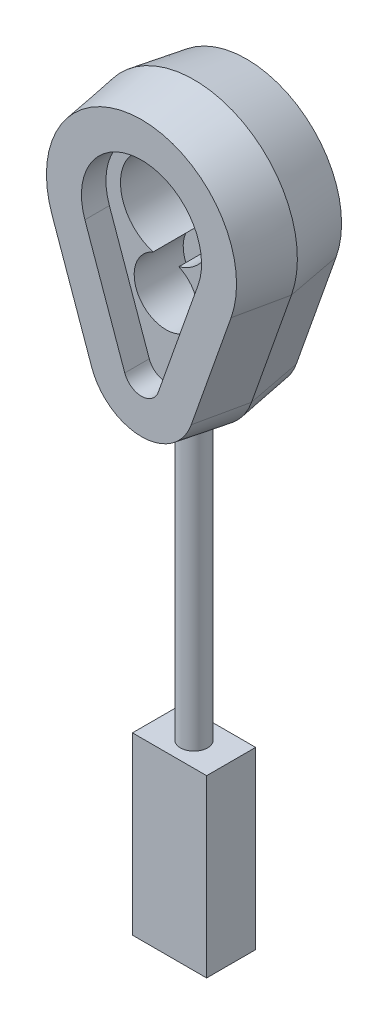
ISO-10303-21;
HEADER;
FILE_DESCRIPTION(('STEP AP214'),'2;1');
FILE_NAME('part.step','',(''),(''),'','','');
FILE_SCHEMA(('AUTOMOTIVE_DESIGN { 1 0 10303 214 1 1 1 1 }'));
ENDSEC;
DATA;
#1=APPLICATION_CONTEXT('core data for automotive mechanical design processes');
#2=APPLICATION_PROTOCOL_DEFINITION('international standard','automotive_design',2000,#1);
#3=PRODUCT_CONTEXT('',#1,'mechanical');
#4=PRODUCT('Part','Part','',(#3));
#5=PRODUCT_RELATED_PRODUCT_CATEGORY('part','',(#4));
#6=PRODUCT_DEFINITION_FORMATION('','',#4);
#7=PRODUCT_DEFINITION_CONTEXT('part definition',#1,'design');
#8=PRODUCT_DEFINITION('design','',#6,#7);
#9=PRODUCT_DEFINITION_SHAPE('','',#8);
#10=(LENGTH_UNIT() NAMED_UNIT(*) SI_UNIT(.MILLI.,.METRE.));
#11=(NAMED_UNIT(*) PLANE_ANGLE_UNIT() SI_UNIT($,.RADIAN.));
#12=(NAMED_UNIT(*) SI_UNIT($,.STERADIAN.) SOLID_ANGLE_UNIT());
#13=UNCERTAINTY_MEASURE_WITH_UNIT(LENGTH_MEASURE(1.E-05),#10,'distance_accuracy_value','');
#14=(GEOMETRIC_REPRESENTATION_CONTEXT(3) GLOBAL_UNCERTAINTY_ASSIGNED_CONTEXT((#13)) GLOBAL_UNIT_ASSIGNED_CONTEXT((#10,
#11,#12)) REPRESENTATION_CONTEXT('',''));
#15=CARTESIAN_POINT('',(0.,0.,0.));
#16=DIRECTION('',(0.,0.,1.));
#17=DIRECTION('',(1.,0.,0.));
#18=AXIS2_PLACEMENT_3D('',#15,#16,#17);
#19=CARTESIAN_POINT('',(0.,16.6037884330398,0.));
#20=DIRECTION('',(0.,-1.,0.));
#21=DIRECTION('',(0.,0.,-1.));
#22=AXIS2_PLACEMENT_3D('',#19,#20,#21);
#23=CYLINDRICAL_SURFACE('',#22,0.98409170703917);
#24=CARTESIAN_POINT('',(-0.98409168671586,-4.4192482256549,-0.000199999999999837));
#25=CARTESIAN_POINT('',(-0.984097085883015,-4.4148724557727,0.0267209709012039));
#26=CARTESIAN_POINT('',(-0.98299713720744,-4.41074650614178,0.0536709824800077));
#27=CARTESIAN_POINT('',(-0.978579087796314,-4.40301483989207,0.107464566228092));
#28=CARTESIAN_POINT('',(-0.975260887306968,-4.39940914667785,0.134308133556011));
#29=CARTESIAN_POINT('',(-0.961983461293486,-4.38941563602825,0.214334748337586));
#30=CARTESIAN_POINT('',(-0.948701468574549,-4.38383584753335,0.2671096010363));
#31=CARTESIAN_POINT('',(-0.913535319976374,-4.3748188937024,0.369930511176929));
#32=CARTESIAN_POINT('',(-0.891643294369421,-4.37138369601482,0.419974024336217));
#33=CARTESIAN_POINT('',(-0.839842823488599,-4.36639739341966,0.515815362262868));
#34=CARTESIAN_POINT('',(-0.809936427896995,-4.36484580733704,0.561614268567212));
#35=CARTESIAN_POINT('',(-0.743067752841407,-4.36319421527238,0.647486222640956));
#36=CARTESIAN_POINT('',(-0.706131512687204,-4.36308895408788,0.687579475797872));
#37=CARTESIAN_POINT('',(-0.626151520612784,-4.36379111371978,0.761133011531106));
#38=CARTESIAN_POINT('',(-0.583106115698386,-4.36459878196637,0.794591493003563));
#39=CARTESIAN_POINT('',(-0.491510686278028,-4.36660279706224,0.854330930791084));
#40=CARTESIAN_POINT('',(-0.442897274471061,-4.36780398505856,0.880514568109824));
#41=CARTESIAN_POINT('',(-0.341983157835609,-4.37009864561681,0.924397800519598));
#42=CARTESIAN_POINT('',(-0.289682684134218,-4.37119212492029,0.942097926866349));
#43=CARTESIAN_POINT('',(-0.182543730984046,-4.37291255498202,0.968595209420589));
#44=CARTESIAN_POINT('',(-0.127692382291647,-4.37353678583686,0.977340565319281));
#45=CARTESIAN_POINT('',(-0.0172954392057737,-4.37411710658356,0.985495261506718));
#46=CARTESIAN_POINT('',(0.0382501663635484,-4.37407318570592,0.984904451311981));
#47=CARTESIAN_POINT('',(0.148313027480209,-4.37333128579104,0.974416896527436));
#48=CARTESIAN_POINT('',(0.202832468550235,-4.37263490900796,0.964542948592992));
#49=CARTESIAN_POINT('',(0.309440593319927,-4.37080420151624,0.935804983113595));
#50=CARTESIAN_POINT('',(0.36152922758899,-4.36966986190595,0.916940782838701));
#51=CARTESIAN_POINT('',(0.46188064893609,-4.3673484208449,0.870723092959069));
#52=CARTESIAN_POINT('',(0.510137977867349,-4.36616124775254,0.843357755605639));
#53=CARTESIAN_POINT('',(0.601386133819344,-4.36424842739828,0.78091442004559));
#54=CARTESIAN_POINT('',(0.64437699227665,-4.36352277738136,0.745836467880537));
#55=CARTESIAN_POINT('',(0.72386382920801,-4.36310225510593,0.668964933705868));
#56=CARTESIAN_POINT('',(0.76036064329411,-4.36340725012951,0.627172217027998));
#57=CARTESIAN_POINT('',(0.82581390785112,-4.3655919967712,0.538072926534506));
#58=CARTESIAN_POINT('',(0.85476986934057,-4.36747185047664,0.490765995441183));
#59=CARTESIAN_POINT('',(0.90402520653008,-4.3731993149354,0.39262868986227));
#60=CARTESIAN_POINT('',(0.924418269097534,-4.37702455928714,0.341843921349668));
#61=CARTESIAN_POINT('',(0.956469007214356,-4.38685608266726,0.237818927856279));
#62=CARTESIAN_POINT('',(0.968136179945701,-4.39285997986361,0.184581439612925));
#63=CARTESIAN_POINT('',(0.978268869969302,-4.40281174786465,0.109147493491658));
#64=CARTESIAN_POINT('',(0.980459961800558,-4.40586554006172,0.087277531910676));
#65=CARTESIAN_POINT('',(0.983371662834753,-4.41230819462531,0.0435326663453332));
#66=CARTESIAN_POINT('',(0.984095126497143,-4.41569639309657,0.0216578548723957));
#67=CARTESIAN_POINT('',(0.98409168671586,-4.4192482256549,-0.000199999999999881));
#68=B_SPLINE_CURVE_WITH_KNOTS('',3,(#24,#25,#26,#27,#28,#29,#30,#31,#32,#33,#34,#35,#36,#37,#38,
#39,#40,#41,#42,#43,#44,#45,#46,#47,#48,#49,#50,#51,#52,#53,#54,#55,#56,#57,#58,#59,#60,#61,#62,
#63,#64,#65,#66,#67),.UNSPECIFIED.,.F.,.F.,(4,2,2,2,2,2,2,2,2,2,2,2,2,2,2,2,2,2,2,2,2,4),(0.,
0.081775321222471,0.163554320092077,0.326824572269268,0.49024440456263,0.653622481909699,
0.816406769527715,0.979235186960103,1.14414709545903,1.30904867546956,1.47489885641223,
1.64075171058691,1.80619833983474,1.97164833198508,2.1373299485835,2.30301057614845,
2.46866986955017,2.63433990234293,2.79814687126805,2.96177529362924,3.02830625466317,
3.09470769193994),.UNSPECIFIED.);
#69=CARTESIAN_POINT('',(-0.98409170703917,-4.41921573268458,0.));
#70=VERTEX_POINT('',#69);
#71=CARTESIAN_POINT('',(0.98409170703917,-4.41921573268458,0.));
#72=VERTEX_POINT('',#71);
#73=EDGE_CURVE('E48',#70,#72,#68,.T.);
#74=ORIENTED_EDGE('',*,*,#73,.F.);
#75=CARTESIAN_POINT('',(-0.98409168671586,-4.4192482256549,0.000199999999999837));
#76=CARTESIAN_POINT('',(-0.984097085883015,-4.4148724557727,-0.0267209709012039));
#77=CARTESIAN_POINT('',(-0.98299713720744,-4.41074650614178,-0.0536709824800077));
#78=CARTESIAN_POINT('',(-0.978579087796314,-4.40301483989207,-0.107464566228092));
#79=CARTESIAN_POINT('',(-0.975260887306968,-4.39940914667785,-0.134308133556011));
#80=CARTESIAN_POINT('',(-0.961983461293486,-4.38941563602825,-0.214334748337586));
#81=CARTESIAN_POINT('',(-0.948701468574549,-4.38383584753335,-0.2671096010363));
#82=CARTESIAN_POINT('',(-0.913535319976374,-4.3748188937024,-0.369930511176929));
#83=CARTESIAN_POINT('',(-0.891643294369421,-4.37138369601482,-0.419974024336217));
#84=CARTESIAN_POINT('',(-0.839842823488599,-4.36639739341966,-0.515815362262868));
#85=CARTESIAN_POINT('',(-0.809936427896995,-4.36484580733704,-0.561614268567212));
#86=CARTESIAN_POINT('',(-0.743067752841407,-4.36319421527238,-0.647486222640956));
#87=CARTESIAN_POINT('',(-0.706131512687204,-4.36308895408788,-0.687579475797872));
#88=CARTESIAN_POINT('',(-0.626151520612784,-4.36379111371978,-0.761133011531106));
#89=CARTESIAN_POINT('',(-0.583106115698386,-4.36459878196637,-0.794591493003563));
#90=CARTESIAN_POINT('',(-0.491510686278028,-4.36660279706224,-0.854330930791084));
#91=CARTESIAN_POINT('',(-0.442897274471061,-4.36780398505856,-0.880514568109824));
#92=CARTESIAN_POINT('',(-0.341983157835609,-4.37009864561681,-0.924397800519598));
#93=CARTESIAN_POINT('',(-0.289682684134218,-4.37119212492029,-0.942097926866349));
#94=CARTESIAN_POINT('',(-0.182543730984046,-4.37291255498202,-0.968595209420589));
#95=CARTESIAN_POINT('',(-0.127692382291647,-4.37353678583686,-0.977340565319281));
#96=CARTESIAN_POINT('',(-0.0172954392057737,-4.37411710658356,-0.985495261506718));
#97=CARTESIAN_POINT('',(0.0382501663635484,-4.37407318570592,-0.984904451311981));
#98=CARTESIAN_POINT('',(0.148313027480209,-4.37333128579104,-0.974416896527436));
#99=CARTESIAN_POINT('',(0.202832468550235,-4.37263490900796,-0.964542948592992));
#100=CARTESIAN_POINT('',(0.309440593319927,-4.37080420151624,-0.935804983113595));
#101=CARTESIAN_POINT('',(0.36152922758899,-4.36966986190595,-0.916940782838701));
#102=CARTESIAN_POINT('',(0.46188064893609,-4.3673484208449,-0.870723092959069));
#103=CARTESIAN_POINT('',(0.510137977867349,-4.36616124775254,-0.843357755605639));
#104=CARTESIAN_POINT('',(0.601386133819344,-4.36424842739828,-0.78091442004559));
#105=CARTESIAN_POINT('',(0.64437699227665,-4.36352277738136,-0.745836467880537));
#106=CARTESIAN_POINT('',(0.72386382920801,-4.36310225510593,-0.668964933705868));
#107=CARTESIAN_POINT('',(0.76036064329411,-4.36340725012951,-0.627172217027998));
#108=CARTESIAN_POINT('',(0.82581390785112,-4.3655919967712,-0.538072926534506));
#109=CARTESIAN_POINT('',(0.85476986934057,-4.36747185047664,-0.490765995441183));
#110=CARTESIAN_POINT('',(0.90402520653008,-4.3731993149354,-0.39262868986227));
#111=CARTESIAN_POINT('',(0.924418269097534,-4.37702455928714,-0.341843921349668));
#112=CARTESIAN_POINT('',(0.956469007214356,-4.38685608266726,-0.237818927856279));
#113=CARTESIAN_POINT('',(0.968136179945701,-4.39285997986361,-0.184581439612925));
#114=CARTESIAN_POINT('',(0.978268869969302,-4.40281174786465,-0.109147493491658));
#115=CARTESIAN_POINT('',(0.980459961800558,-4.40586554006172,-0.087277531910676));
#116=CARTESIAN_POINT('',(0.983371662834753,-4.41230819462531,-0.0435326663453332));
#117=CARTESIAN_POINT('',(0.984095126497143,-4.41569639309657,-0.0216578548723957));
#118=CARTESIAN_POINT('',(0.98409168671586,-4.4192482256549,0.000199999999999881));
#119=B_SPLINE_CURVE_WITH_KNOTS('',3,(#75,#76,#77,#78,#79,#80,#81,#82,#83,#84,#85,#86,#87,#88,
#89,#90,#91,#92,#93,#94,#95,#96,#97,#98,#99,#100,#101,#102,#103,#104,#105,#106,#107,#108,#109,
#110,#111,#112,#113,#114,#115,#116,#117,#118),.UNSPECIFIED.,.F.,.F.,(4,2,2,2,2,2,2,2,2,2,2,2,2,
2,2,2,2,2,2,2,2,4),(0.,0.081775321222471,0.163554320092077,0.326824572269268,0.49024440456263,
0.653622481909699,0.816406769527715,0.979235186960103,1.14414709545903,1.30904867546956,
1.47489885641223,1.64075171058691,1.80619833983474,1.97164833198508,2.1373299485835,
2.30301057614845,2.46866986955017,2.63433990234293,2.79814687126805,2.96177529362924,
3.02830625466317,3.09470769193994),.UNSPECIFIED.);
#120=EDGE_CURVE('E178',#70,#72,#119,.T.);
#121=ORIENTED_EDGE('',*,*,#120,.T.);
#122=EDGE_LOOP('',(#74,#121));
#123=FACE_BOUND('',#122,.T.);
#124=CARTESIAN_POINT('',(0.,-24.8940277258508,0.));
#125=DIRECTION('',(0.,-1.,0.));
#126=DIRECTION('',(0.,0.,-1.));
#127=AXIS2_PLACEMENT_3D('',#124,#125,#126);
#128=CIRCLE('',#127,0.98409170703917);
#129=CARTESIAN_POINT('',(0.,-24.8940277258508,-0.98409170703917));
#130=VERTEX_POINT('',#129);
#131=EDGE_CURVE('E11',#130,#130,#128,.T.);
#132=ORIENTED_EDGE('',*,*,#131,.F.);
#133=EDGE_LOOP('',(#132));
#134=FACE_BOUND('',#133,.T.);
#135=ADVANCED_FACE('F33',(#123,#134),#23,.T.);
#136=CARTESIAN_POINT('',(0.,-0.0991043185791118,0.));
#137=DIRECTION('',(0.,0.,1.));
#138=DIRECTION('',(1.,0.,0.));
#139=AXIS2_PLACEMENT_3D('',#136,#137,#138);
#140=CONICAL_SURFACE('',#139,4.43077861308231,0.15707963267949);
#141=CARTESIAN_POINT('',(0.,-0.0991043185791118,0.));
#142=DIRECTION('',(0.,0.,1.));
#143=DIRECTION('',(1.,0.,0.));
#144=AXIS2_PLACEMENT_3D('',#141,#142,#143);
#145=CIRCLE('',#144,4.43077861308231);
#146=CARTESIAN_POINT('',(4.17699368519334,-1.57711746872445,0.));
#147=VERTEX_POINT('',#146);
#148=EDGE_CURVE('E252',#72,#147,#145,.T.);
#149=ORIENTED_EDGE('',*,*,#148,.F.);
#150=ORIENTED_EDGE('',*,*,#120,.F.);
#151=CARTESIAN_POINT('',(-4.17699368519334,-1.57711746872445,0.));
#152=VERTEX_POINT('',#151);
#153=EDGE_CURVE('E249',#152,#70,#145,.T.);
#154=ORIENTED_EDGE('',*,*,#153,.F.);
#155=DIRECTION('',(-0.147474254455038,-0.0521831977302444,0.987688340595138));
#156=VECTOR('',#155,1.);
#157=CARTESIAN_POINT('',(-4.17699368519334,-1.57711746872445,0.));
#158=LINE('',#157,#156);
#159=CARTESIAN_POINT('',(-3.60811290936568,-1.37582119420081,-3.81));
#160=VERTEX_POINT('',#159);
#161=EDGE_CURVE('E271',#160,#152,#158,.T.);
#162=ORIENTED_EDGE('',*,*,#161,.F.);
#163=CARTESIAN_POINT('',(0.,-0.0991043185791118,-3.81));
#164=DIRECTION('',(0.,0.,-1.));
#165=DIRECTION('',(-1.,0.,0.));
#166=AXIS2_PLACEMENT_3D('',#163,#164,#165);
#167=CIRCLE('',#166,3.82733389544583);
#168=CARTESIAN_POINT('',(3.60811290936568,-1.37582119420081,-3.81));
#169=VERTEX_POINT('',#168);
#170=EDGE_CURVE('E280',#160,#169,#167,.F.);
#171=ORIENTED_EDGE('',*,*,#170,.T.);
#172=DIRECTION('',(0.147474254455039,-0.0521831977302444,0.987688340595138));
#173=VECTOR('',#172,1.);
#174=CARTESIAN_POINT('',(4.17699368519334,-1.57711746872445,0.));
#175=LINE('',#174,#173);
#176=EDGE_CURVE('E254',#169,#147,#175,.T.);
#177=ORIENTED_EDGE('',*,*,#176,.T.);
#178=EDGE_LOOP('',(#149,#150,#154,#162,#171,#177));
#179=FACE_BOUND('',#178,.T.);
#180=ADVANCED_FACE('F223',(#179),#140,.T.);
#181=CARTESIAN_POINT('',(0.,-0.0991043185791118,0.));
#182=DIRECTION('',(0.,0.,-1.));
#183=DIRECTION('',(1.,0.,0.));
#184=AXIS2_PLACEMENT_3D('',#181,#182,#183);
#185=CONICAL_SURFACE('',#184,4.43077861308231,0.15707963267949);
#186=ORIENTED_EDGE('',*,*,#73,.T.);
#187=ORIENTED_EDGE('',*,*,#148,.T.);
#188=DIRECTION('',(0.147474254455038,-0.0521831977302444,-0.987688340595138));
#189=VECTOR('',#188,1.);
#190=CARTESIAN_POINT('',(4.17699368519334,-1.57711746872444,0.));
#191=LINE('',#190,#189);
#192=CARTESIAN_POINT('',(3.60811290936568,-1.37582119420081,3.81));
#193=VERTEX_POINT('',#192);
#194=EDGE_CURVE('E303',#193,#147,#191,.T.);
#195=ORIENTED_EDGE('',*,*,#194,.F.);
#196=CARTESIAN_POINT('',(0.,-0.0991043185791118,3.81));
#197=DIRECTION('',(0.,0.,-1.));
#198=DIRECTION('',(-1.,0.,0.));
#199=AXIS2_PLACEMENT_3D('',#196,#197,#198);
#200=CIRCLE('',#199,3.82733389544583);
#201=CARTESIAN_POINT('',(-3.60811290936568,-1.37582119420082,3.81));
#202=VERTEX_POINT('',#201);
#203=EDGE_CURVE('E313',#202,#193,#200,.F.);
#204=ORIENTED_EDGE('',*,*,#203,.F.);
#205=DIRECTION('',(-0.147474254455038,-0.0521831977302444,-0.987688340595138));
#206=VECTOR('',#205,1.);
#207=CARTESIAN_POINT('',(-4.17699368519334,-1.57711746872445,0.));
#208=LINE('',#207,#206);
#209=EDGE_CURVE('E311',#202,#152,#208,.T.);
#210=ORIENTED_EDGE('',*,*,#209,.T.);
#211=ORIENTED_EDGE('',*,*,#153,.T.);
#212=EDGE_LOOP('',(#186,#187,#195,#204,#210,#211));
#213=FACE_BOUND('',#212,.T.);
#214=ADVANCED_FACE('F228',(#213),#185,.T.);
#215=CARTESIAN_POINT('',(0.,9.10178843303984,0.));
#216=DIRECTION('',(0.,0.,1.));
#217=DIRECTION('',(-1.,0.,0.));
#218=AXIS2_PLACEMENT_3D('',#215,#216,#217);
#219=CONICAL_SURFACE('',#218,7.5,0.15707963267949);
#220=CARTESIAN_POINT('',(0.,9.10178843303984,0.));
#221=DIRECTION('',(0.,0.,1.));
#222=DIRECTION('',(-1.,0.,0.));
#223=AXIS2_PLACEMENT_3D('',#220,#221,#222);
#224=CIRCLE('',#223,7.5);
#225=CARTESIAN_POINT('',(7.07041704734528,6.59994855474843,0.));
#226=VERTEX_POINT('',#225);
#227=CARTESIAN_POINT('',(-7.07041704734528,6.59994855474843,0.));
#228=VERTEX_POINT('',#227);
#229=EDGE_CURVE('E260',#226,#228,#224,.T.);
#230=ORIENTED_EDGE('',*,*,#229,.F.);
#231=DIRECTION('',(0.147474254455038,-0.0521831977302444,0.987688340595138));
#232=VECTOR('',#231,1.);
#233=CARTESIAN_POINT('',(7.07041704734528,6.59994855474843,0.));
#234=LINE('',#233,#232);
#235=CARTESIAN_POINT('',(6.50153627151762,6.80124482927206,-3.81));
#236=VERTEX_POINT('',#235);
#237=EDGE_CURVE('E41',#236,#226,#234,.T.);
#238=ORIENTED_EDGE('',*,*,#237,.F.);
#239=CARTESIAN_POINT('',(0.,9.10178843303984,-3.81));
#240=DIRECTION('',(0.,0.,-1.));
#241=DIRECTION('',(-1.,0.,0.));
#242=AXIS2_PLACEMENT_3D('',#239,#240,#241);
#243=CIRCLE('',#242,6.89655528236352);
#244=CARTESIAN_POINT('',(-6.50153627151763,6.80124482927206,-3.81));
#245=VERTEX_POINT('',#244);
#246=EDGE_CURVE('E266',#236,#245,#243,.F.);
#247=ORIENTED_EDGE('',*,*,#246,.T.);
#248=DIRECTION('',(-0.147474254455039,-0.0521831977302444,0.987688340595138));
#249=VECTOR('',#248,1.);
#250=CARTESIAN_POINT('',(-7.07041704734529,6.59994855474843,0.));
#251=LINE('',#250,#249);
#252=EDGE_CURVE('E269',#245,#228,#251,.T.);
#253=ORIENTED_EDGE('',*,*,#252,.T.);
#254=EDGE_LOOP('',(#230,#238,#247,#253));
#255=FACE_BOUND('',#254,.T.);
#256=ADVANCED_FACE('F292',(#255),#219,.T.);
#257=CARTESIAN_POINT('',(7.07041704734528,6.59994855474843,0.));
#258=DIRECTION('',(0.931115797441072,-0.329471743709918,-0.156434465040231));
#259=DIRECTION('',(0.333578650438855,0.942722272979371,0.));
#260=AXIS2_PLACEMENT_3D('',#257,#258,#259);
#261=PLANE('',#260);
#262=DIRECTION('',(0.333578650438855,0.942722272979371,0.));
#263=VECTOR('',#262,1.);
#264=CARTESIAN_POINT('',(7.07041704734528,6.59994855474843,0.));
#265=LINE('',#264,#263);
#266=EDGE_CURVE('E259',#147,#226,#265,.T.);
#267=ORIENTED_EDGE('',*,*,#266,.F.);
#268=ORIENTED_EDGE('',*,*,#176,.F.);
#269=DIRECTION('',(0.333578650438855,0.942722272979371,0.));
#270=VECTOR('',#269,1.);
#271=CARTESIAN_POINT('',(6.50153627151762,6.80124482927206,-3.81));
#272=LINE('',#271,#270);
#273=EDGE_CURVE('E272',#169,#236,#272,.T.);
#274=ORIENTED_EDGE('',*,*,#273,.T.);
#275=ORIENTED_EDGE('',*,*,#237,.T.);
#276=EDGE_LOOP('',(#267,#268,#274,#275));
#277=FACE_BOUND('',#276,.T.);
#278=ADVANCED_FACE('F35',(#277),#261,.T.);
#279=CARTESIAN_POINT('',(-7.07041704734528,6.59994855474843,0.));
#280=DIRECTION('',(-0.931115797441072,-0.329471743709918,-0.156434465040231));
#281=DIRECTION('',(0.333578650438855,-0.942722272979371,0.));
#282=AXIS2_PLACEMENT_3D('',#279,#280,#281);
#283=PLANE('',#282);
#284=DIRECTION('',(0.333578650438855,-0.942722272979371,0.));
#285=VECTOR('',#284,1.);
#286=CARTESIAN_POINT('',(-7.07041704734528,6.59994855474843,0.));
#287=LINE('',#286,#285);
#288=EDGE_CURVE('E257',#228,#152,#287,.T.);
#289=ORIENTED_EDGE('',*,*,#288,.F.);
#290=ORIENTED_EDGE('',*,*,#252,.F.);
#291=DIRECTION('',(0.333578650438855,-0.942722272979371,0.));
#292=VECTOR('',#291,1.);
#293=CARTESIAN_POINT('',(-6.50153627151762,6.80124482927206,-3.81));
#294=LINE('',#293,#292);
#295=EDGE_CURVE('E277',#245,#160,#294,.T.);
#296=ORIENTED_EDGE('',*,*,#295,.T.);
#297=ORIENTED_EDGE('',*,*,#161,.T.);
#298=EDGE_LOOP('',(#289,#290,#296,#297));
#299=FACE_BOUND('',#298,.T.);
#300=ADVANCED_FACE('F285',(#299),#283,.T.);
#301=CARTESIAN_POINT('',(0.,9.10178843303984,-3.81));
#302=DIRECTION('',(0.,0.,-1.));
#303=DIRECTION('',(-1.,0.,0.));
#304=AXIS2_PLACEMENT_3D('',#301,#302,#303);
#305=PLANE('',#304);
#306=ORIENTED_EDGE('',*,*,#246,.F.);
#307=ORIENTED_EDGE('',*,*,#273,.F.);
#308=ORIENTED_EDGE('',*,*,#170,.F.);
#309=ORIENTED_EDGE('',*,*,#295,.F.);
#310=EDGE_LOOP('',(#306,#307,#308,#309));
#311=FACE_BOUND('',#310,.T.);
#312=ADVANCED_FACE('F289',(#311),#305,.T.);
#313=CARTESIAN_POINT('',(0.,9.10178843303984,0.));
#314=DIRECTION('',(0.,0.,-1.));
#315=DIRECTION('',(-1.,0.,0.));
#316=AXIS2_PLACEMENT_3D('',#313,#314,#315);
#317=CONICAL_SURFACE('',#316,7.5,0.15707963267949);
#318=ORIENTED_EDGE('',*,*,#229,.T.);
#319=DIRECTION('',(-0.147474254455038,-0.0521831977302444,-0.987688340595138));
#320=VECTOR('',#319,1.);
#321=CARTESIAN_POINT('',(-7.07041704734528,6.59994855474843,0.));
#322=LINE('',#321,#320);
#323=CARTESIAN_POINT('',(-6.50153627151762,6.80124482927206,3.81));
#324=VERTEX_POINT('',#323);
#325=EDGE_CURVE('E316',#324,#228,#322,.T.);
#326=ORIENTED_EDGE('',*,*,#325,.F.);
#327=CARTESIAN_POINT('',(0.,9.10178843303984,3.81));
#328=DIRECTION('',(0.,0.,-1.));
#329=DIRECTION('',(-1.,0.,0.));
#330=AXIS2_PLACEMENT_3D('',#327,#328,#329);
#331=CIRCLE('',#330,6.89655528236352);
#332=CARTESIAN_POINT('',(6.50153627151762,6.80124482927207,3.81));
#333=VERTEX_POINT('',#332);
#334=EDGE_CURVE('E308',#333,#324,#331,.F.);
#335=ORIENTED_EDGE('',*,*,#334,.F.);
#336=DIRECTION('',(0.147474254455039,-0.0521831977302443,-0.987688340595138));
#337=VECTOR('',#336,1.);
#338=CARTESIAN_POINT('',(7.07041704734528,6.59994855474843,0.));
#339=LINE('',#338,#337);
#340=EDGE_CURVE('E301',#333,#226,#339,.T.);
#341=ORIENTED_EDGE('',*,*,#340,.T.);
#342=EDGE_LOOP('',(#318,#326,#335,#341));
#343=FACE_BOUND('',#342,.T.);
#344=ADVANCED_FACE('F305',(#343),#317,.T.);
#345=CARTESIAN_POINT('',(-7.07041704734528,6.59994855474843,0.));
#346=DIRECTION('',(-0.931115797441072,-0.329471743709918,0.156434465040231));
#347=DIRECTION('',(0.333578650438855,-0.942722272979371,0.));
#348=AXIS2_PLACEMENT_3D('',#345,#346,#347);
#349=PLANE('',#348);
#350=ORIENTED_EDGE('',*,*,#288,.T.);
#351=ORIENTED_EDGE('',*,*,#209,.F.);
#352=DIRECTION('',(-0.333578650438855,0.942722272979371,0.));
#353=VECTOR('',#352,1.);
#354=CARTESIAN_POINT('',(-6.50153627151762,6.80124482927206,3.81));
#355=LINE('',#354,#353);
#356=EDGE_CURVE('E322',#324,#202,#355,.F.);
#357=ORIENTED_EDGE('',*,*,#356,.F.);
#358=ORIENTED_EDGE('',*,*,#325,.T.);
#359=EDGE_LOOP('',(#350,#351,#357,#358));
#360=FACE_BOUND('',#359,.T.);
#361=ADVANCED_FACE('F327',(#360),#349,.T.);
#362=CARTESIAN_POINT('',(7.07041704734528,6.59994855474843,0.));
#363=DIRECTION('',(0.931115797441072,-0.329471743709918,0.156434465040231));
#364=DIRECTION('',(0.333578650438855,0.942722272979371,0.));
#365=AXIS2_PLACEMENT_3D('',#362,#363,#364);
#366=PLANE('',#365);
#367=ORIENTED_EDGE('',*,*,#266,.T.);
#368=ORIENTED_EDGE('',*,*,#340,.F.);
#369=DIRECTION('',(-0.333578650438855,-0.942722272979371,0.));
#370=VECTOR('',#369,1.);
#371=CARTESIAN_POINT('',(6.50153627151762,6.80124482927206,3.81));
#372=LINE('',#371,#370);
#373=EDGE_CURVE('E309',#193,#333,#372,.F.);
#374=ORIENTED_EDGE('',*,*,#373,.F.);
#375=ORIENTED_EDGE('',*,*,#194,.T.);
#376=EDGE_LOOP('',(#367,#368,#374,#375));
#377=FACE_BOUND('',#376,.T.);
#378=ADVANCED_FACE('F299',(#377),#366,.T.);
#379=CARTESIAN_POINT('',(0.,9.10178843303984,3.81));
#380=DIRECTION('',(0.,0.,-1.));
#381=DIRECTION('',(-1.,0.,0.));
#382=AXIS2_PLACEMENT_3D('',#379,#380,#381);
#383=PLANE('',#382);
#384=CARTESIAN_POINT('',(0.,9.10178843303984,3.81));
#385=DIRECTION('',(0.,0.,1.));
#386=DIRECTION('',(1.,0.,0.));
#387=AXIS2_PLACEMENT_3D('',#384,#385,#386);
#388=CIRCLE('',#387,4.35655528236351);
#389=CARTESIAN_POINT('',(4.10702169815002,7.64853460138676,3.81));
#390=VERTEX_POINT('',#389);
#391=CARTESIAN_POINT('',(-4.10702169815002,7.64853460138676,3.81));
#392=VERTEX_POINT('',#391);
#393=EDGE_CURVE('E570',#390,#392,#388,.T.);
#394=ORIENTED_EDGE('',*,*,#393,.F.);
#395=DIRECTION('',(0.333578650438854,0.942722272979372,0.));
#396=VECTOR('',#395,1.);
#397=CARTESIAN_POINT('',(1.21359833599808,-0.528531422086122,3.81));
#398=LINE('',#397,#396);
#399=CARTESIAN_POINT('',(1.21359833599808,-0.528531422086123,3.81));
#400=VERTEX_POINT('',#399);
#401=EDGE_CURVE('E553',#400,#390,#398,.T.);
#402=ORIENTED_EDGE('',*,*,#401,.F.);
#403=CARTESIAN_POINT('',(0.,-0.0991043185791118,3.81));
#404=DIRECTION('',(0.,0.,1.));
#405=DIRECTION('',(1.,0.,0.));
#406=AXIS2_PLACEMENT_3D('',#403,#404,#405);
#407=CIRCLE('',#406,1.28733389544583);
#408=CARTESIAN_POINT('',(-1.21359833599808,-0.528531422086125,3.81));
#409=VERTEX_POINT('',#408);
#410=EDGE_CURVE('E559',#409,#400,#407,.T.);
#411=ORIENTED_EDGE('',*,*,#410,.F.);
#412=DIRECTION('',(0.333578650438855,-0.942722272979371,0.));
#413=VECTOR('',#412,1.);
#414=CARTESIAN_POINT('',(-4.10702169815002,7.64853460138676,3.81));
#415=LINE('',#414,#413);
#416=EDGE_CURVE('E573',#392,#409,#415,.T.);
#417=ORIENTED_EDGE('',*,*,#416,.F.);
#418=EDGE_LOOP('',(#394,#402,#411,#417));
#419=FACE_BOUND('',#418,.T.);
#420=ORIENTED_EDGE('',*,*,#334,.T.);
#421=ORIENTED_EDGE('',*,*,#356,.T.);
#422=ORIENTED_EDGE('',*,*,#203,.T.);
#423=ORIENTED_EDGE('',*,*,#373,.T.);
#424=EDGE_LOOP('',(#420,#421,#422,#423));
#425=FACE_BOUND('',#424,.T.);
#426=ADVANCED_FACE('F331',(#419,#425),#383,.F.);
#427=CARTESIAN_POINT('',(1.21359833599808,-0.528531422086122,2.032));
#428=DIRECTION('',(0.942722272979371,-0.333578650438854,0.));
#429=DIRECTION('',(0.333578650438854,0.942722272979372,0.));
#430=AXIS2_PLACEMENT_3D('',#427,#428,#429);
#431=PLANE('',#430);
#432=ORIENTED_EDGE('',*,*,#401,.T.);
#433=DIRECTION('',(0.,0.,1.));
#434=VECTOR('',#433,1.);
#435=CARTESIAN_POINT('',(4.10702169815002,7.64853460138676,2.032));
#436=LINE('',#435,#434);
#437=CARTESIAN_POINT('',(4.10702169815002,7.64853460138676,2.032));
#438=VERTEX_POINT('',#437);
#439=EDGE_CURVE('E568',#438,#390,#436,.T.);
#440=ORIENTED_EDGE('',*,*,#439,.F.);
#441=DIRECTION('',(0.333578650438854,0.942722272979372,0.));
#442=VECTOR('',#441,1.);
#443=CARTESIAN_POINT('',(1.21359833599808,-0.528531422086122,2.032));
#444=LINE('',#443,#442);
#445=CARTESIAN_POINT('',(1.21359833599808,-0.528531422086123,2.032));
#446=VERTEX_POINT('',#445);
#447=EDGE_CURVE('E555',#446,#438,#444,.T.);
#448=ORIENTED_EDGE('',*,*,#447,.F.);
#449=DIRECTION('',(0.,0.,1.));
#450=VECTOR('',#449,1.);
#451=CARTESIAN_POINT('',(1.21359833599808,-0.528531422086123,2.032));
#452=LINE('',#451,#450);
#453=EDGE_CURVE('E323',#446,#400,#452,.T.);
#454=ORIENTED_EDGE('',*,*,#453,.T.);
#455=EDGE_LOOP('',(#432,#440,#448,#454));
#456=FACE_BOUND('',#455,.T.);
#457=ADVANCED_FACE('F402',(#456),#431,.F.);
#458=CARTESIAN_POINT('',(0.,-0.0991043185791118,2.032));
#459=DIRECTION('',(0.,0.,1.));
#460=DIRECTION('',(1.,0.,0.));
#461=AXIS2_PLACEMENT_3D('',#458,#459,#460);
#462=CYLINDRICAL_SURFACE('',#461,1.28733389544583);
#463=ORIENTED_EDGE('',*,*,#410,.T.);
#464=ORIENTED_EDGE('',*,*,#453,.F.);
#465=CARTESIAN_POINT('',(0.,-0.0991043185791118,2.032));
#466=DIRECTION('',(0.,0.,1.));
#467=DIRECTION('',(1.,0.,0.));
#468=AXIS2_PLACEMENT_3D('',#465,#466,#467);
#469=CIRCLE('',#468,1.28733389544583);
#470=CARTESIAN_POINT('',(-1.21359833599808,-0.528531422086125,2.032));
#471=VERTEX_POINT('',#470);
#472=EDGE_CURVE('E565',#471,#446,#469,.T.);
#473=ORIENTED_EDGE('',*,*,#472,.F.);
#474=DIRECTION('',(0.,0.,1.));
#475=VECTOR('',#474,1.);
#476=CARTESIAN_POINT('',(-1.21359833599808,-0.528531422086125,2.032));
#477=LINE('',#476,#475);
#478=EDGE_CURVE('E579',#471,#409,#477,.T.);
#479=ORIENTED_EDGE('',*,*,#478,.T.);
#480=EDGE_LOOP('',(#463,#464,#473,#479));
#481=FACE_BOUND('',#480,.T.);
#482=ADVANCED_FACE('F411',(#481),#462,.F.);
#483=CARTESIAN_POINT('',(-4.10702169815002,7.64853460138676,2.032));
#484=DIRECTION('',(-0.942722272979371,-0.333578650438855,0.));
#485=DIRECTION('',(0.333578650438855,-0.942722272979372,0.));
#486=AXIS2_PLACEMENT_3D('',#483,#484,#485);
#487=PLANE('',#486);
#488=ORIENTED_EDGE('',*,*,#416,.T.);
#489=ORIENTED_EDGE('',*,*,#478,.F.);
#490=DIRECTION('',(0.333578650438855,-0.942722272979371,0.));
#491=VECTOR('',#490,1.);
#492=CARTESIAN_POINT('',(-4.10702169815002,7.64853460138676,2.032));
#493=LINE('',#492,#491);
#494=CARTESIAN_POINT('',(-4.10702169815002,7.64853460138676,2.032));
#495=VERTEX_POINT('',#494);
#496=EDGE_CURVE('E562',#495,#471,#493,.T.);
#497=ORIENTED_EDGE('',*,*,#496,.F.);
#498=DIRECTION('',(0.,0.,1.));
#499=VECTOR('',#498,1.);
#500=CARTESIAN_POINT('',(-4.10702169815002,7.64853460138676,2.032));
#501=LINE('',#500,#499);
#502=EDGE_CURVE('E581',#495,#392,#501,.T.);
#503=ORIENTED_EDGE('',*,*,#502,.T.);
#504=EDGE_LOOP('',(#488,#489,#497,#503));
#505=FACE_BOUND('',#504,.T.);
#506=ADVANCED_FACE('F420',(#505),#487,.F.);
#507=CARTESIAN_POINT('',(0.,9.10178843303984,2.032));
#508=DIRECTION('',(0.,0.,1.));
#509=DIRECTION('',(1.,0.,0.));
#510=AXIS2_PLACEMENT_3D('',#507,#508,#509);
#511=CYLINDRICAL_SURFACE('',#510,4.35655528236351);
#512=ORIENTED_EDGE('',*,*,#393,.T.);
#513=ORIENTED_EDGE('',*,*,#502,.F.);
#514=CARTESIAN_POINT('',(0.,9.10178843303984,2.032));
#515=DIRECTION('',(0.,0.,1.));
#516=DIRECTION('',(1.,0.,0.));
#517=AXIS2_PLACEMENT_3D('',#514,#515,#516);
#518=CIRCLE('',#517,4.35655528236351);
#519=EDGE_CURVE('E558',#438,#495,#518,.T.);
#520=ORIENTED_EDGE('',*,*,#519,.F.);
#521=ORIENTED_EDGE('',*,*,#439,.T.);
#522=EDGE_LOOP('',(#512,#513,#520,#521));
#523=FACE_BOUND('',#522,.T.);
#524=ADVANCED_FACE('F429',(#523),#511,.F.);
#525=CARTESIAN_POINT('',(0.,9.10178843303984,2.032));
#526=DIRECTION('',(0.,0.,1.));
#527=DIRECTION('',(1.,0.,0.));
#528=AXIS2_PLACEMENT_3D('',#525,#526,#527);
#529=PLANE('',#528);
#530=CARTESIAN_POINT('',(0.,4.21617782948138,2.032));
#531=DIRECTION('',(0.,0.,1.));
#532=DIRECTION('',(1.,0.,0.));
#533=AXIS2_PLACEMENT_3D('',#530,#531,#532);
#534=CIRCLE('',#533,2.30800721714163);
#535=CARTESIAN_POINT('',(-0.93045079958129,6.32832333203001,2.032));
#536=VERTEX_POINT('',#535);
#537=CARTESIAN_POINT('',(0.930450799581286,6.32832333203001,2.032));
#538=VERTEX_POINT('',#537);
#539=EDGE_CURVE('E56',#536,#538,#534,.T.);
#540=ORIENTED_EDGE('',*,*,#539,.F.);
#541=CARTESIAN_POINT('',(0.,9.49796357640165,2.032));
#542=DIRECTION('',(0.,0.,1.));
#543=DIRECTION('',(1.,0.,0.));
#544=AXIS2_PLACEMENT_3D('',#541,#542,#543);
#545=CIRCLE('',#544,3.30338583413772);
#546=EDGE_CURVE('E543',#538,#536,#545,.T.);
#547=ORIENTED_EDGE('',*,*,#546,.F.);
#548=EDGE_LOOP('',(#540,#547));
#549=FACE_BOUND('',#548,.T.);
#550=ORIENTED_EDGE('',*,*,#447,.T.);
#551=ORIENTED_EDGE('',*,*,#519,.T.);
#552=ORIENTED_EDGE('',*,*,#496,.T.);
#553=ORIENTED_EDGE('',*,*,#472,.T.);
#554=EDGE_LOOP('',(#550,#551,#552,#553));
#555=FACE_BOUND('',#554,.T.);
#556=ADVANCED_FACE('F438',(#549,#555),#529,.T.);
#557=CARTESIAN_POINT('',(0.,4.21617782948138,-1.524));
#558=DIRECTION('',(0.,0.,1.));
#559=DIRECTION('',(1.,0.,0.));
#560=AXIS2_PLACEMENT_3D('',#557,#558,#559);
#561=CYLINDRICAL_SURFACE('',#560,2.30800721714163);
#562=ORIENTED_EDGE('',*,*,#539,.T.);
#563=DIRECTION('',(0.,0.,1.));
#564=VECTOR('',#563,1.);
#565=CARTESIAN_POINT('',(0.930450799581286,6.32832333203001,-1.524));
#566=LINE('',#565,#564);
#567=CARTESIAN_POINT('',(0.930450799581286,6.32832333203001,-1.524));
#568=VERTEX_POINT('',#567);
#569=EDGE_CURVE('E545',#568,#538,#566,.T.);
#570=ORIENTED_EDGE('',*,*,#569,.F.);
#571=CARTESIAN_POINT('',(0.,4.21617782948138,-1.524));
#572=DIRECTION('',(0.,0.,1.));
#573=DIRECTION('',(1.,0.,0.));
#574=AXIS2_PLACEMENT_3D('',#571,#572,#573);
#575=CIRCLE('',#574,2.30800721714163);
#576=CARTESIAN_POINT('',(-0.93045079958129,6.32832333203001,-1.524));
#577=VERTEX_POINT('',#576);
#578=EDGE_CURVE('E540',#577,#568,#575,.T.);
#579=ORIENTED_EDGE('',*,*,#578,.F.);
#580=DIRECTION('',(0.,0.,1.));
#581=VECTOR('',#580,1.);
#582=CARTESIAN_POINT('',(-0.93045079958129,6.32832333203001,-1.524));
#583=LINE('',#582,#581);
#584=EDGE_CURVE('E547',#577,#536,#583,.T.);
#585=ORIENTED_EDGE('',*,*,#584,.T.);
#586=EDGE_LOOP('',(#562,#570,#579,#585));
#587=FACE_BOUND('',#586,.T.);
#588=ADVANCED_FACE('F447',(#587),#561,.F.);
#589=CARTESIAN_POINT('',(0.,9.49796357640165,-1.524));
#590=DIRECTION('',(0.,0.,1.));
#591=DIRECTION('',(1.,0.,0.));
#592=AXIS2_PLACEMENT_3D('',#589,#590,#591);
#593=CYLINDRICAL_SURFACE('',#592,3.30338583413772);
#594=ORIENTED_EDGE('',*,*,#546,.T.);
#595=ORIENTED_EDGE('',*,*,#584,.F.);
#596=CARTESIAN_POINT('',(0.,9.49796357640165,-1.524));
#597=DIRECTION('',(0.,0.,1.));
#598=DIRECTION('',(1.,0.,0.));
#599=AXIS2_PLACEMENT_3D('',#596,#597,#598);
#600=CIRCLE('',#599,3.30338583413772);
#601=EDGE_CURVE('E542',#568,#577,#600,.T.);
#602=ORIENTED_EDGE('',*,*,#601,.F.);
#603=ORIENTED_EDGE('',*,*,#569,.T.);
#604=EDGE_LOOP('',(#594,#595,#602,#603));
#605=FACE_BOUND('',#604,.T.);
#606=ADVANCED_FACE('F456',(#605),#593,.F.);
#607=CARTESIAN_POINT('',(0.,6.85707070294151,-1.524));
#608=DIRECTION('',(0.,0.,1.));
#609=DIRECTION('',(1.,0.,0.));
#610=AXIS2_PLACEMENT_3D('',#607,#608,#609);
#611=PLANE('',#610);
#612=ORIENTED_EDGE('',*,*,#578,.T.);
#613=ORIENTED_EDGE('',*,*,#601,.T.);
#614=EDGE_LOOP('',(#612,#613));
#615=FACE_BOUND('',#614,.T.);
#616=ADVANCED_FACE('F204',(#615),#611,.T.);
#617=CARTESIAN_POINT('',(-2.68705879090596,-24.8940277258508,1.778));
#618=DIRECTION('',(1.,0.,0.));
#619=DIRECTION('',(0.,1.,0.));
#620=AXIS2_PLACEMENT_3D('',#617,#618,#619);
#621=PLANE('',#620);
#622=DIRECTION('',(0.,-1.,0.));
#623=VECTOR('',#622,1.);
#624=CARTESIAN_POINT('',(-2.68705879090596,-24.8940277258508,-1.778));
#625=LINE('',#624,#623);
#626=CARTESIAN_POINT('',(-2.68705879090596,-24.8940277258508,-1.778));
#627=VERTEX_POINT('',#626);
#628=CARTESIAN_POINT('',(-2.68705879090596,-37.607567608638,-1.778));
#629=VERTEX_POINT('',#628);
#630=EDGE_CURVE('E176',#627,#629,#625,.T.);
#631=ORIENTED_EDGE('',*,*,#630,.T.);
#632=DIRECTION('',(0.,0.,-1.));
#633=VECTOR('',#632,1.);
#634=CARTESIAN_POINT('',(-2.68705879090596,-37.607567608638,1.778));
#635=LINE('',#634,#633);
#636=CARTESIAN_POINT('',(-2.68705879090596,-37.607567608638,1.778));
#637=VERTEX_POINT('',#636);
#638=EDGE_CURVE('E156',#637,#629,#635,.T.);
#639=ORIENTED_EDGE('',*,*,#638,.F.);
#640=DIRECTION('',(0.,-1.,0.));
#641=VECTOR('',#640,1.);
#642=CARTESIAN_POINT('',(-2.68705879090596,-24.8940277258508,1.778));
#643=LINE('',#642,#641);
#644=CARTESIAN_POINT('',(-2.68705879090596,-24.8940277258508,1.778));
#645=VERTEX_POINT('',#644);
#646=EDGE_CURVE('E163',#645,#637,#643,.T.);
#647=ORIENTED_EDGE('',*,*,#646,.F.);
#648=DIRECTION('',(0.,0.,-1.));
#649=VECTOR('',#648,1.);
#650=CARTESIAN_POINT('',(-2.68705879090596,-24.8940277258508,1.778));
#651=LINE('',#650,#649);
#652=EDGE_CURVE('E235',#645,#627,#651,.T.);
#653=ORIENTED_EDGE('',*,*,#652,.T.);
#654=EDGE_LOOP('',(#631,#639,#647,#653));
#655=FACE_BOUND('',#654,.T.);
#656=ADVANCED_FACE('F174',(#655),#621,.F.);
#657=CARTESIAN_POINT('',(-2.68705879090596,-37.607567608638,1.778));
#658=DIRECTION('',(0.,1.,0.));
#659=DIRECTION('',(0.,0.,1.));
#660=AXIS2_PLACEMENT_3D('',#657,#658,#659);
#661=PLANE('',#660);
#662=DIRECTION('',(1.,0.,0.));
#663=VECTOR('',#662,1.);
#664=CARTESIAN_POINT('',(-2.68705879090596,-37.607567608638,-1.778));
#665=LINE('',#664,#663);
#666=CARTESIAN_POINT('',(2.69402088041329,-37.607567608638,-1.778));
#667=VERTEX_POINT('',#666);
#668=EDGE_CURVE('E241',#629,#667,#665,.T.);
#669=ORIENTED_EDGE('',*,*,#668,.T.);
#670=DIRECTION('',(0.,0.,-1.));
#671=VECTOR('',#670,1.);
#672=CARTESIAN_POINT('',(2.69402088041329,-37.607567608638,1.778));
#673=LINE('',#672,#671);
#674=CARTESIAN_POINT('',(2.69402088041329,-37.607567608638,1.778));
#675=VERTEX_POINT('',#674);
#676=EDGE_CURVE('E159',#675,#667,#673,.T.);
#677=ORIENTED_EDGE('',*,*,#676,.F.);
#678=DIRECTION('',(1.,0.,0.));
#679=VECTOR('',#678,1.);
#680=CARTESIAN_POINT('',(-2.68705879090596,-37.607567608638,1.778));
#681=LINE('',#680,#679);
#682=EDGE_CURVE('E152',#637,#675,#681,.T.);
#683=ORIENTED_EDGE('',*,*,#682,.F.);
#684=ORIENTED_EDGE('',*,*,#638,.T.);
#685=EDGE_LOOP('',(#669,#677,#683,#684));
#686=FACE_BOUND('',#685,.T.);
#687=ADVANCED_FACE('F154',(#686),#661,.F.);
#688=CARTESIAN_POINT('',(2.69402088041328,-24.8940277258508,1.778));
#689=DIRECTION('',(-1.,0.,0.));
#690=DIRECTION('',(0.,-1.,0.));
#691=AXIS2_PLACEMENT_3D('',#688,#689,#690);
#692=PLANE('',#691);
#693=DIRECTION('',(0.,1.,0.));
#694=VECTOR('',#693,1.);
#695=CARTESIAN_POINT('',(2.69402088041328,-24.8940277258508,-1.778));
#696=LINE('',#695,#694);
#697=CARTESIAN_POINT('',(2.69402088041328,-24.8940277258508,-1.778));
#698=VERTEX_POINT('',#697);
#699=EDGE_CURVE('E238',#667,#698,#696,.T.);
#700=ORIENTED_EDGE('',*,*,#699,.T.);
#701=DIRECTION('',(0.,0.,-1.));
#702=VECTOR('',#701,1.);
#703=CARTESIAN_POINT('',(2.69402088041328,-24.8940277258508,1.778));
#704=LINE('',#703,#702);
#705=CARTESIAN_POINT('',(2.69402088041328,-24.8940277258508,1.778));
#706=VERTEX_POINT('',#705);
#707=EDGE_CURVE('E180',#706,#698,#704,.T.);
#708=ORIENTED_EDGE('',*,*,#707,.F.);
#709=DIRECTION('',(0.,1.,0.));
#710=VECTOR('',#709,1.);
#711=CARTESIAN_POINT('',(2.69402088041328,-24.8940277258508,1.778));
#712=LINE('',#711,#710);
#713=EDGE_CURVE('E162',#675,#706,#712,.T.);
#714=ORIENTED_EDGE('',*,*,#713,.F.);
#715=ORIENTED_EDGE('',*,*,#676,.T.);
#716=EDGE_LOOP('',(#700,#708,#714,#715));
#717=FACE_BOUND('',#716,.T.);
#718=ADVANCED_FACE('F207',(#717),#692,.F.);
#719=CARTESIAN_POINT('',(-2.68705879090596,-24.8940277258508,1.778));
#720=DIRECTION('',(0.,-1.,0.));
#721=DIRECTION('',(0.,0.,-1.));
#722=AXIS2_PLACEMENT_3D('',#719,#720,#721);
#723=PLANE('',#722);
#724=ORIENTED_EDGE('',*,*,#131,.T.);
#725=EDGE_LOOP('',(#724));
#726=FACE_BOUND('',#725,.T.);
#727=DIRECTION('',(-1.,0.,0.));
#728=VECTOR('',#727,1.);
#729=CARTESIAN_POINT('',(-2.68705879090596,-24.8940277258508,-1.778));
#730=LINE('',#729,#728);
#731=EDGE_CURVE('E172',#698,#627,#730,.T.);
#732=ORIENTED_EDGE('',*,*,#731,.T.);
#733=ORIENTED_EDGE('',*,*,#652,.F.);
#734=DIRECTION('',(-1.,0.,0.));
#735=VECTOR('',#734,1.);
#736=CARTESIAN_POINT('',(-2.68705879090596,-24.8940277258508,1.778));
#737=LINE('',#736,#735);
#738=EDGE_CURVE('E168',#706,#645,#737,.T.);
#739=ORIENTED_EDGE('',*,*,#738,.F.);
#740=ORIENTED_EDGE('',*,*,#707,.T.);
#741=EDGE_LOOP('',(#732,#733,#739,#740));
#742=FACE_BOUND('',#741,.T.);
#743=ADVANCED_FACE('F210',(#726,#742),#723,.F.);
#744=CARTESIAN_POINT('',(0.,0.,1.778));
#745=DIRECTION('',(0.,0.,1.));
#746=DIRECTION('',(1.,0.,0.));
#747=AXIS2_PLACEMENT_3D('',#744,#745,#746);
#748=PLANE('',#747);
#749=ORIENTED_EDGE('',*,*,#646,.T.);
#750=ORIENTED_EDGE('',*,*,#682,.T.);
#751=ORIENTED_EDGE('',*,*,#713,.T.);
#752=ORIENTED_EDGE('',*,*,#738,.T.);
#753=EDGE_LOOP('',(#749,#750,#751,#752));
#754=FACE_BOUND('',#753,.T.);
#755=ADVANCED_FACE('F166',(#754),#748,.T.);
#756=CARTESIAN_POINT('',(0.,0.,-1.778));
#757=DIRECTION('',(0.,0.,1.));
#758=DIRECTION('',(1.,0.,0.));
#759=AXIS2_PLACEMENT_3D('',#756,#757,#758);
#760=PLANE('',#759);
#761=ORIENTED_EDGE('',*,*,#630,.F.);
#762=ORIENTED_EDGE('',*,*,#731,.F.);
#763=ORIENTED_EDGE('',*,*,#699,.F.);
#764=ORIENTED_EDGE('',*,*,#668,.F.);
#765=EDGE_LOOP('',(#761,#762,#763,#764));
#766=FACE_BOUND('',#765,.T.);
#767=ADVANCED_FACE('F215',(#766),#760,.F.);
#768=CLOSED_SHELL('',(#135,#180,#214,#256,#278,#300,#312,#344,#361,#378,#426,#457,#482,#506,
#524,#556,#588,#606,#616,#656,#687,#718,#743,#755,#767));
#769=MANIFOLD_SOLID_BREP('B2',#768);
#770=ADVANCED_BREP_SHAPE_REPRESENTATION('',(#18,#769),#14);
#771=SHAPE_DEFINITION_REPRESENTATION(#9,#770);
ENDSEC;
END-ISO-10303-21;
